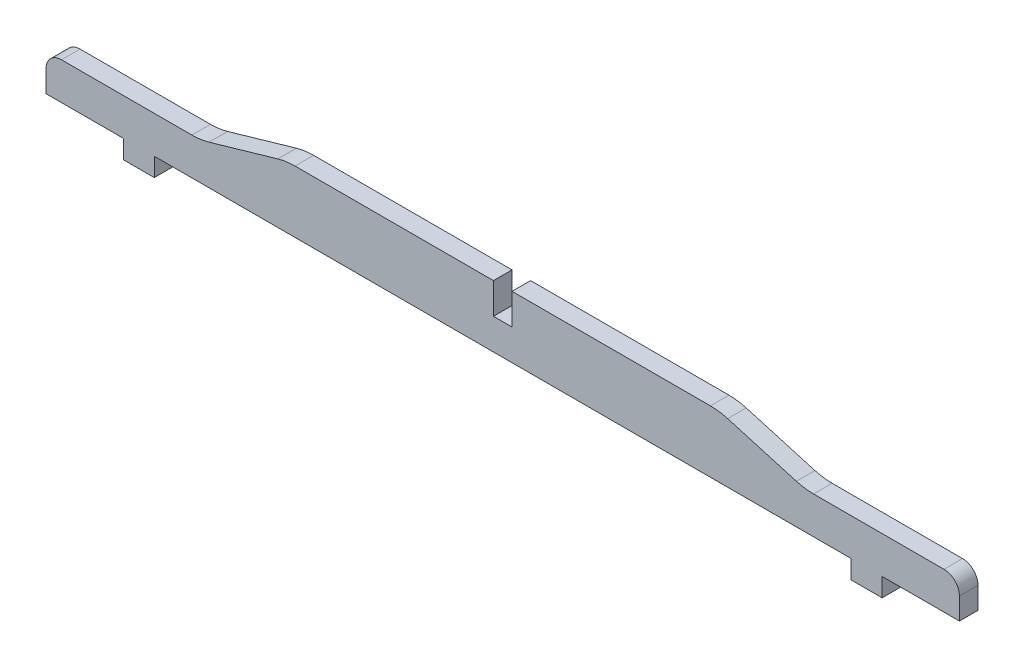
ISO-10303-21;
HEADER;
FILE_DESCRIPTION(('STEP AP214'),'2;1');
FILE_NAME('part.step','',(''),(''),'','','');
FILE_SCHEMA(('AUTOMOTIVE_DESIGN { 1 0 10303 214 1 1 1 1 }'));
ENDSEC;
DATA;
#1=APPLICATION_CONTEXT('core data for automotive mechanical design processes');
#2=APPLICATION_PROTOCOL_DEFINITION('international standard','automotive_design',2000,#1);
#3=PRODUCT_CONTEXT('',#1,'mechanical');
#4=PRODUCT('Part','Part','',(#3));
#5=PRODUCT_RELATED_PRODUCT_CATEGORY('part','',(#4));
#6=PRODUCT_DEFINITION_FORMATION('','',#4);
#7=PRODUCT_DEFINITION_CONTEXT('part definition',#1,'design');
#8=PRODUCT_DEFINITION('design','',#6,#7);
#9=PRODUCT_DEFINITION_SHAPE('','',#8);
#10=(LENGTH_UNIT() NAMED_UNIT(*) SI_UNIT(.MILLI.,.METRE.));
#11=(NAMED_UNIT(*) PLANE_ANGLE_UNIT() SI_UNIT($,.RADIAN.));
#12=(NAMED_UNIT(*) SI_UNIT($,.STERADIAN.) SOLID_ANGLE_UNIT());
#13=UNCERTAINTY_MEASURE_WITH_UNIT(LENGTH_MEASURE(1.E-05),#10,'distance_accuracy_value','');
#14=(GEOMETRIC_REPRESENTATION_CONTEXT(3) GLOBAL_UNCERTAINTY_ASSIGNED_CONTEXT((#13)) GLOBAL_UNIT_ASSIGNED_CONTEXT((#10,
#11,#12)) REPRESENTATION_CONTEXT('',''));
#15=CARTESIAN_POINT('',(0.,0.,0.));
#16=DIRECTION('',(0.,0.,1.));
#17=DIRECTION('',(1.,0.,0.));
#18=AXIS2_PLACEMENT_3D('',#15,#16,#17);
#19=CARTESIAN_POINT('',(70.,0.,6.));
#20=DIRECTION('',(0.,-1.,0.));
#21=DIRECTION('',(0.,0.,-1.));
#22=AXIS2_PLACEMENT_3D('',#19,#20,#21);
#23=PLANE('',#22);
#24=DIRECTION('',(-1.,0.,0.));
#25=VECTOR('',#24,1.);
#26=CARTESIAN_POINT('',(70.,0.,6.));
#27=LINE('',#26,#25);
#28=CARTESIAN_POINT('',(-3.,0.,6.));
#29=VERTEX_POINT('',#28);
#30=CARTESIAN_POINT('',(-67.1664737660185,0.,6.));
#31=VERTEX_POINT('',#30);
#32=EDGE_CURVE('E261',#29,#31,#27,.T.);
#33=ORIENTED_EDGE('',*,*,#32,.F.);
#34=DIRECTION('',(0.,0.,1.));
#35=VECTOR('',#34,1.);
#36=CARTESIAN_POINT('',(-3.,0.,0.));
#37=LINE('',#36,#35);
#38=CARTESIAN_POINT('',(-3.,0.,0.));
#39=VERTEX_POINT('',#38);
#40=EDGE_CURVE('E234',#39,#29,#37,.T.);
#41=ORIENTED_EDGE('',*,*,#40,.F.);
#42=DIRECTION('',(-1.,0.,0.));
#43=VECTOR('',#42,1.);
#44=CARTESIAN_POINT('',(70.,0.,0.));
#45=LINE('',#44,#43);
#46=CARTESIAN_POINT('',(-67.1664737660185,0.,0.));
#47=VERTEX_POINT('',#46);
#48=EDGE_CURVE('E230',#39,#47,#45,.T.);
#49=ORIENTED_EDGE('',*,*,#48,.T.);
#50=DIRECTION('',(0.,0.,-1.));
#51=VECTOR('',#50,1.);
#52=CARTESIAN_POINT('',(-67.1664737660185,0.,6.));
#53=LINE('',#52,#51);
#54=EDGE_CURVE('E378',#47,#31,#53,.F.);
#55=ORIENTED_EDGE('',*,*,#54,.T.);
#56=EDGE_LOOP('',(#33,#41,#49,#55));
#57=FACE_BOUND('',#56,.T.);
#58=ADVANCED_FACE('F38',(#57),#23,.F.);
#59=CARTESIAN_POINT('',(122.66666667,-26.,6.));
#60=DIRECTION('',(-1.,0.,0.));
#61=DIRECTION('',(0.,0.,1.));
#62=AXIS2_PLACEMENT_3D('',#59,#60,#61);
#63=PLANE('',#62);
#64=DIRECTION('',(0.,1.,0.));
#65=VECTOR('',#64,1.);
#66=CARTESIAN_POINT('',(122.66666667,-26.,0.));
#67=LINE('',#66,#65);
#68=CARTESIAN_POINT('',(122.66666667,-26.,0.));
#69=VERTEX_POINT('',#68);
#70=CARTESIAN_POINT('',(122.66666667,-20.,0.));
#71=VERTEX_POINT('',#70);
#72=EDGE_CURVE('E245',#69,#71,#67,.T.);
#73=ORIENTED_EDGE('',*,*,#72,.T.);
#74=DIRECTION('',(0.,0.,-1.));
#75=VECTOR('',#74,1.);
#76=CARTESIAN_POINT('',(122.66666667,-20.,6.));
#77=LINE('',#76,#75);
#78=CARTESIAN_POINT('',(122.66666667,-20.,6.));
#79=VERTEX_POINT('',#78);
#80=EDGE_CURVE('E348',#79,#71,#77,.T.);
#81=ORIENTED_EDGE('',*,*,#80,.F.);
#82=DIRECTION('',(0.,1.,0.));
#83=VECTOR('',#82,1.);
#84=CARTESIAN_POINT('',(122.66666667,-26.,6.));
#85=LINE('',#84,#83);
#86=CARTESIAN_POINT('',(122.66666667,-26.,6.));
#87=VERTEX_POINT('',#86);
#88=EDGE_CURVE('E246',#87,#79,#85,.T.);
#89=ORIENTED_EDGE('',*,*,#88,.F.);
#90=DIRECTION('',(0.,0.,-1.));
#91=VECTOR('',#90,1.);
#92=CARTESIAN_POINT('',(122.66666667,-26.,6.));
#93=LINE('',#92,#91);
#94=EDGE_CURVE('E285',#87,#69,#93,.T.);
#95=ORIENTED_EDGE('',*,*,#94,.T.);
#96=EDGE_LOOP('',(#73,#81,#89,#95));
#97=FACE_BOUND('',#96,.T.);
#98=ADVANCED_FACE('F464',(#97),#63,.F.);
#99=CARTESIAN_POINT('',(147.66666667,-20.,6.));
#100=DIRECTION('',(0.,1.,0.));
#101=DIRECTION('',(0.,0.,1.));
#102=AXIS2_PLACEMENT_3D('',#99,#100,#101);
#103=PLANE('',#102);
#104=DIRECTION('',(1.,0.,0.));
#105=VECTOR('',#104,1.);
#106=CARTESIAN_POINT('',(147.66666667,-20.,0.));
#107=LINE('',#106,#105);
#108=CARTESIAN_POINT('',(147.66666667,-20.,0.));
#109=VERTEX_POINT('',#108);
#110=EDGE_CURVE('E288',#71,#109,#107,.T.);
#111=ORIENTED_EDGE('',*,*,#110,.T.);
#112=DIRECTION('',(0.,0.,-1.));
#113=VECTOR('',#112,1.);
#114=CARTESIAN_POINT('',(147.66666667,-20.,6.));
#115=LINE('',#114,#113);
#116=CARTESIAN_POINT('',(147.66666667,-20.,6.));
#117=VERTEX_POINT('',#116);
#118=EDGE_CURVE('E345',#117,#109,#115,.T.);
#119=ORIENTED_EDGE('',*,*,#118,.F.);
#120=DIRECTION('',(1.,0.,0.));
#121=VECTOR('',#120,1.);
#122=CARTESIAN_POINT('',(147.66666667,-20.,6.));
#123=LINE('',#122,#121);
#124=EDGE_CURVE('E249',#79,#117,#123,.T.);
#125=ORIENTED_EDGE('',*,*,#124,.F.);
#126=ORIENTED_EDGE('',*,*,#80,.T.);
#127=EDGE_LOOP('',(#111,#119,#125,#126));
#128=FACE_BOUND('',#127,.T.);
#129=ADVANCED_FACE('F467',(#128),#103,.F.);
#130=CARTESIAN_POINT('',(147.66666667,-8.00000000000002,6.));
#131=DIRECTION('',(-1.,0.,0.));
#132=DIRECTION('',(0.,-1.,0.));
#133=AXIS2_PLACEMENT_3D('',#130,#131,#132);
#134=PLANE('',#133);
#135=DIRECTION('',(0.,1.,0.));
#136=VECTOR('',#135,1.);
#137=CARTESIAN_POINT('',(147.66666667,-8.00000000000002,0.));
#138=LINE('',#137,#136);
#139=CARTESIAN_POINT('',(147.66666667,-13.,0.));
#140=VERTEX_POINT('',#139);
#141=EDGE_CURVE('E290',#109,#140,#138,.T.);
#142=ORIENTED_EDGE('',*,*,#141,.T.);
#143=DIRECTION('',(0.,0.,-1.));
#144=VECTOR('',#143,1.);
#145=CARTESIAN_POINT('',(147.66666667,-13.,6.));
#146=LINE('',#145,#144);
#147=CARTESIAN_POINT('',(147.66666667,-13.,6.));
#148=VERTEX_POINT('',#147);
#149=EDGE_CURVE('E359',#140,#148,#146,.F.);
#150=ORIENTED_EDGE('',*,*,#149,.T.);
#151=DIRECTION('',(0.,1.,0.));
#152=VECTOR('',#151,1.);
#153=CARTESIAN_POINT('',(147.66666667,-8.00000000000002,6.));
#154=LINE('',#153,#152);
#155=EDGE_CURVE('E252',#117,#148,#154,.T.);
#156=ORIENTED_EDGE('',*,*,#155,.F.);
#157=ORIENTED_EDGE('',*,*,#118,.T.);
#158=EDGE_LOOP('',(#142,#150,#156,#157));
#159=FACE_BOUND('',#158,.T.);
#160=ADVANCED_FACE('F471',(#159),#134,.F.);
#161=CARTESIAN_POINT('',(97.66666667,-8.00000000000002,6.));
#162=DIRECTION('',(0.,-1.,0.));
#163=DIRECTION('',(1.,0.,0.));
#164=AXIS2_PLACEMENT_3D('',#161,#162,#163);
#165=PLANE('',#164);
#166=DIRECTION('',(-1.,0.,0.));
#167=VECTOR('',#166,1.);
#168=CARTESIAN_POINT('',(97.66666667,-8.00000000000002,0.));
#169=LINE('',#168,#167);
#170=CARTESIAN_POINT('',(142.66666667,-8.00000000000002,0.));
#171=VERTEX_POINT('',#170);
#172=CARTESIAN_POINT('',(100.500192903982,-8.00000000000002,0.));
#173=VERTEX_POINT('',#172);
#174=EDGE_CURVE('E293',#171,#173,#169,.T.);
#175=ORIENTED_EDGE('',*,*,#174,.T.);
#176=DIRECTION('',(0.,0.,-1.));
#177=VECTOR('',#176,1.);
#178=CARTESIAN_POINT('',(100.500192903982,-8.00000000000002,6.));
#179=LINE('',#178,#177);
#180=CARTESIAN_POINT('',(100.500192903982,-8.00000000000002,6.));
#181=VERTEX_POINT('',#180);
#182=EDGE_CURVE('E376',#173,#181,#179,.F.);
#183=ORIENTED_EDGE('',*,*,#182,.T.);
#184=DIRECTION('',(-1.,0.,0.));
#185=VECTOR('',#184,1.);
#186=CARTESIAN_POINT('',(97.66666667,-8.00000000000002,6.));
#187=LINE('',#186,#185);
#188=CARTESIAN_POINT('',(142.66666667,-8.00000000000002,6.));
#189=VERTEX_POINT('',#188);
#190=EDGE_CURVE('E255',#189,#181,#187,.T.);
#191=ORIENTED_EDGE('',*,*,#190,.F.);
#192=DIRECTION('',(0.,0.,-1.));
#193=VECTOR('',#192,1.);
#194=CARTESIAN_POINT('',(142.66666667,-8.00000000000002,6.));
#195=LINE('',#194,#193);
#196=EDGE_CURVE('E351',#189,#171,#195,.T.);
#197=ORIENTED_EDGE('',*,*,#196,.T.);
#198=EDGE_LOOP('',(#175,#183,#191,#197));
#199=FACE_BOUND('',#198,.T.);
#200=ADVANCED_FACE('F480',(#199),#165,.F.);
#201=CARTESIAN_POINT('',(70.,0.,6.));
#202=DIRECTION('',(-0.277777033532158,-0.960645574414453,0.));
#203=DIRECTION('',(0.960645574414453,-0.277777033532158,0.));
#204=AXIS2_PLACEMENT_3D('',#201,#202,#203);
#205=PLANE('',#204);
#206=DIRECTION('',(-0.960645574414453,0.277777033532158,0.));
#207=VECTOR('',#206,1.);
#208=CARTESIAN_POINT('',(70.,0.,6.));
#209=LINE('',#208,#207);
#210=CARTESIAN_POINT('',(94.9446522333384,-7.21291148828908,6.));
#211=VERTEX_POINT('',#210);
#212=CARTESIAN_POINT('',(72.7220144366616,-0.787088511710961,6.));
#213=VERTEX_POINT('',#212);
#214=EDGE_CURVE('E258',#211,#213,#209,.T.);
#215=ORIENTED_EDGE('',*,*,#214,.F.);
#216=DIRECTION('',(0.,0.,-1.));
#217=VECTOR('',#216,1.);
#218=CARTESIAN_POINT('',(94.9446522333384,-7.21291148828908,0.));
#219=LINE('',#218,#217);
#220=CARTESIAN_POINT('',(94.9446522333384,-7.21291148828908,0.));
#221=VERTEX_POINT('',#220);
#222=EDGE_CURVE('E373',#211,#221,#219,.T.);
#223=ORIENTED_EDGE('',*,*,#222,.T.);
#224=DIRECTION('',(-0.960645574414453,0.277777033532158,0.));
#225=VECTOR('',#224,1.);
#226=CARTESIAN_POINT('',(70.,0.,0.));
#227=LINE('',#226,#225);
#228=CARTESIAN_POINT('',(72.7220144366616,-0.787088511710961,0.));
#229=VERTEX_POINT('',#228);
#230=EDGE_CURVE('E296',#221,#229,#227,.T.);
#231=ORIENTED_EDGE('',*,*,#230,.T.);
#232=DIRECTION('',(0.,0.,-1.));
#233=VECTOR('',#232,1.);
#234=CARTESIAN_POINT('',(72.7220144366616,-0.787088511710961,6.));
#235=LINE('',#234,#233);
#236=EDGE_CURVE('E371',#229,#213,#235,.F.);
#237=ORIENTED_EDGE('',*,*,#236,.T.);
#238=EDGE_LOOP('',(#215,#223,#231,#237));
#239=FACE_BOUND('',#238,.T.);
#240=ADVANCED_FACE('F489',(#239),#205,.F.);
#241=CARTESIAN_POINT('',(67.1664737660185,0.,0.));
#242=VERTEX_POINT('',#241);
#243=CARTESIAN_POINT('',(3.,0.,0.));
#244=VERTEX_POINT('',#243);
#245=EDGE_CURVE('E299',#242,#244,#45,.T.);
#246=ORIENTED_EDGE('',*,*,#245,.T.);
#247=DIRECTION('',(0.,0.,1.));
#248=VECTOR('',#247,1.);
#249=CARTESIAN_POINT('',(3.,0.,0.));
#250=LINE('',#249,#248);
#251=CARTESIAN_POINT('',(3.,0.,6.));
#252=VERTEX_POINT('',#251);
#253=EDGE_CURVE('E237',#244,#252,#250,.T.);
#254=ORIENTED_EDGE('',*,*,#253,.T.);
#255=CARTESIAN_POINT('',(67.1664737660185,0.,6.));
#256=VERTEX_POINT('',#255);
#257=EDGE_CURVE('E262',#256,#252,#27,.T.);
#258=ORIENTED_EDGE('',*,*,#257,.F.);
#259=DIRECTION('',(0.,0.,-1.));
#260=VECTOR('',#259,1.);
#261=CARTESIAN_POINT('',(67.1664737660185,0.,6.));
#262=LINE('',#261,#260);
#263=EDGE_CURVE('E381',#256,#242,#262,.T.);
#264=ORIENTED_EDGE('',*,*,#263,.T.);
#265=EDGE_LOOP('',(#246,#254,#258,#264));
#266=FACE_BOUND('',#265,.T.);
#267=ADVANCED_FACE('F498',(#266),#23,.F.);
#268=CARTESIAN_POINT('',(-97.66666667,-8.00000000000002,6.));
#269=DIRECTION('',(0.277777033532158,-0.960645574414453,0.));
#270=DIRECTION('',(0.960645574414453,0.277777033532158,0.));
#271=AXIS2_PLACEMENT_3D('',#268,#269,#270);
#272=PLANE('',#271);
#273=DIRECTION('',(-0.960645574414453,-0.277777033532158,0.));
#274=VECTOR('',#273,1.);
#275=CARTESIAN_POINT('',(-97.66666667,-8.00000000000002,6.));
#276=LINE('',#275,#274);
#277=CARTESIAN_POINT('',(-72.7220144366616,-0.787088511710957,6.));
#278=VERTEX_POINT('',#277);
#279=CARTESIAN_POINT('',(-94.9446522333383,-7.21291148828908,6.));
#280=VERTEX_POINT('',#279);
#281=EDGE_CURVE('E265',#278,#280,#276,.T.);
#282=ORIENTED_EDGE('',*,*,#281,.F.);
#283=DIRECTION('',(0.,0.,-1.));
#284=VECTOR('',#283,1.);
#285=CARTESIAN_POINT('',(-72.7220144366616,-0.787088511710958,6.));
#286=LINE('',#285,#284);
#287=CARTESIAN_POINT('',(-72.7220144366616,-0.787088511710957,0.));
#288=VERTEX_POINT('',#287);
#289=EDGE_CURVE('E394',#278,#288,#286,.T.);
#290=ORIENTED_EDGE('',*,*,#289,.T.);
#291=DIRECTION('',(-0.960645574414453,-0.277777033532158,0.));
#292=VECTOR('',#291,1.);
#293=CARTESIAN_POINT('',(-97.66666667,-8.00000000000002,0.));
#294=LINE('',#293,#292);
#295=CARTESIAN_POINT('',(-94.9446522333383,-7.21291148828908,0.));
#296=VERTEX_POINT('',#295);
#297=EDGE_CURVE('E302',#288,#296,#294,.T.);
#298=ORIENTED_EDGE('',*,*,#297,.T.);
#299=DIRECTION('',(0.,0.,-1.));
#300=VECTOR('',#299,1.);
#301=CARTESIAN_POINT('',(-94.9446522333383,-7.21291148828908,6.));
#302=LINE('',#301,#300);
#303=EDGE_CURVE('E392',#296,#280,#302,.F.);
#304=ORIENTED_EDGE('',*,*,#303,.T.);
#305=EDGE_LOOP('',(#282,#290,#298,#304));
#306=FACE_BOUND('',#305,.T.);
#307=ADVANCED_FACE('F410',(#306),#272,.F.);
#308=CARTESIAN_POINT('',(-147.66666667,-8.00000000000002,6.));
#309=DIRECTION('',(0.,-1.,0.));
#310=DIRECTION('',(1.,0.,0.));
#311=AXIS2_PLACEMENT_3D('',#308,#309,#310);
#312=PLANE('',#311);
#313=DIRECTION('',(-1.,0.,0.));
#314=VECTOR('',#313,1.);
#315=CARTESIAN_POINT('',(-147.66666667,-8.00000000000002,6.));
#316=LINE('',#315,#314);
#317=CARTESIAN_POINT('',(-100.500192903981,-8.00000000000002,6.));
#318=VERTEX_POINT('',#317);
#319=CARTESIAN_POINT('',(-142.66666667,-8.00000000000002,6.));
#320=VERTEX_POINT('',#319);
#321=EDGE_CURVE('E267',#318,#320,#316,.T.);
#322=ORIENTED_EDGE('',*,*,#321,.F.);
#323=DIRECTION('',(0.,0.,-1.));
#324=VECTOR('',#323,1.);
#325=CARTESIAN_POINT('',(-100.500192903981,-8.00000000000003,0.));
#326=LINE('',#325,#324);
#327=CARTESIAN_POINT('',(-100.500192903981,-8.00000000000002,0.));
#328=VERTEX_POINT('',#327);
#329=EDGE_CURVE('E397',#318,#328,#326,.T.);
#330=ORIENTED_EDGE('',*,*,#329,.T.);
#331=DIRECTION('',(-1.,0.,0.));
#332=VECTOR('',#331,1.);
#333=CARTESIAN_POINT('',(-147.66666667,-8.00000000000002,0.));
#334=LINE('',#333,#332);
#335=CARTESIAN_POINT('',(-142.66666667,-8.00000000000002,0.));
#336=VERTEX_POINT('',#335);
#337=EDGE_CURVE('E305',#328,#336,#334,.T.);
#338=ORIENTED_EDGE('',*,*,#337,.T.);
#339=DIRECTION('',(0.,0.,-1.));
#340=VECTOR('',#339,1.);
#341=CARTESIAN_POINT('',(-142.66666667,-8.00000000000002,6.));
#342=LINE('',#341,#340);
#343=EDGE_CURVE('E368',#336,#320,#342,.F.);
#344=ORIENTED_EDGE('',*,*,#343,.T.);
#345=EDGE_LOOP('',(#322,#330,#338,#344));
#346=FACE_BOUND('',#345,.T.);
#347=ADVANCED_FACE('F413',(#346),#312,.F.);
#348=CARTESIAN_POINT('',(-147.66666667,-20.,6.));
#349=DIRECTION('',(1.,0.,0.));
#350=DIRECTION('',(0.,1.,0.));
#351=AXIS2_PLACEMENT_3D('',#348,#349,#350);
#352=PLANE('',#351);
#353=DIRECTION('',(0.,-1.,0.));
#354=VECTOR('',#353,1.);
#355=CARTESIAN_POINT('',(-147.66666667,-20.,6.));
#356=LINE('',#355,#354);
#357=CARTESIAN_POINT('',(-147.66666667,-13.,6.));
#358=VERTEX_POINT('',#357);
#359=CARTESIAN_POINT('',(-147.66666667,-20.,6.));
#360=VERTEX_POINT('',#359);
#361=EDGE_CURVE('E269',#358,#360,#356,.T.);
#362=ORIENTED_EDGE('',*,*,#361,.F.);
#363=DIRECTION('',(0.,0.,-1.));
#364=VECTOR('',#363,1.);
#365=CARTESIAN_POINT('',(-147.66666667,-13.,6.));
#366=LINE('',#365,#364);
#367=CARTESIAN_POINT('',(-147.66666667,-13.,0.));
#368=VERTEX_POINT('',#367);
#369=EDGE_CURVE('E365',#358,#368,#366,.T.);
#370=ORIENTED_EDGE('',*,*,#369,.T.);
#371=DIRECTION('',(0.,-1.,0.));
#372=VECTOR('',#371,1.);
#373=CARTESIAN_POINT('',(-147.66666667,-20.,0.));
#374=LINE('',#373,#372);
#375=CARTESIAN_POINT('',(-147.66666667,-20.,0.));
#376=VERTEX_POINT('',#375);
#377=EDGE_CURVE('E307',#368,#376,#374,.T.);
#378=ORIENTED_EDGE('',*,*,#377,.T.);
#379=DIRECTION('',(0.,0.,-1.));
#380=VECTOR('',#379,1.);
#381=CARTESIAN_POINT('',(-147.66666667,-20.,6.));
#382=LINE('',#381,#380);
#383=EDGE_CURVE('E342',#360,#376,#382,.T.);
#384=ORIENTED_EDGE('',*,*,#383,.F.);
#385=EDGE_LOOP('',(#362,#370,#378,#384));
#386=FACE_BOUND('',#385,.T.);
#387=ADVANCED_FACE('F422',(#386),#352,.F.);
#388=CARTESIAN_POINT('',(-147.66666667,-20.,6.));
#389=DIRECTION('',(0.,1.,0.));
#390=DIRECTION('',(0.,0.,1.));
#391=AXIS2_PLACEMENT_3D('',#388,#389,#390);
#392=PLANE('',#391);
#393=DIRECTION('',(1.,0.,0.));
#394=VECTOR('',#393,1.);
#395=CARTESIAN_POINT('',(-147.66666667,-20.,0.));
#396=LINE('',#395,#394);
#397=CARTESIAN_POINT('',(-122.66666667,-20.,0.));
#398=VERTEX_POINT('',#397);
#399=EDGE_CURVE('E309',#376,#398,#396,.T.);
#400=ORIENTED_EDGE('',*,*,#399,.T.);
#401=DIRECTION('',(0.,0.,-1.));
#402=VECTOR('',#401,1.);
#403=CARTESIAN_POINT('',(-122.66666667,-20.,6.));
#404=LINE('',#403,#402);
#405=CARTESIAN_POINT('',(-122.66666667,-20.,6.));
#406=VERTEX_POINT('',#405);
#407=EDGE_CURVE('E339',#406,#398,#404,.T.);
#408=ORIENTED_EDGE('',*,*,#407,.F.);
#409=DIRECTION('',(1.,0.,0.));
#410=VECTOR('',#409,1.);
#411=CARTESIAN_POINT('',(-147.66666667,-20.,6.));
#412=LINE('',#411,#410);
#413=EDGE_CURVE('E271',#360,#406,#412,.T.);
#414=ORIENTED_EDGE('',*,*,#413,.F.);
#415=ORIENTED_EDGE('',*,*,#383,.T.);
#416=EDGE_LOOP('',(#400,#408,#414,#415));
#417=FACE_BOUND('',#416,.T.);
#418=ADVANCED_FACE('F429',(#417),#392,.F.);
#419=CARTESIAN_POINT('',(-122.66666667,-20.,6.));
#420=DIRECTION('',(1.,0.,0.));
#421=DIRECTION('',(0.,0.,-1.));
#422=AXIS2_PLACEMENT_3D('',#419,#420,#421);
#423=PLANE('',#422);
#424=DIRECTION('',(0.,-1.,0.));
#425=VECTOR('',#424,1.);
#426=CARTESIAN_POINT('',(-122.66666667,-20.,0.));
#427=LINE('',#426,#425);
#428=CARTESIAN_POINT('',(-122.66666667,-26.,0.));
#429=VERTEX_POINT('',#428);
#430=EDGE_CURVE('E311',#398,#429,#427,.T.);
#431=ORIENTED_EDGE('',*,*,#430,.T.);
#432=DIRECTION('',(0.,0.,-1.));
#433=VECTOR('',#432,1.);
#434=CARTESIAN_POINT('',(-122.66666667,-26.,6.));
#435=LINE('',#434,#433);
#436=CARTESIAN_POINT('',(-122.66666667,-26.,6.));
#437=VERTEX_POINT('',#436);
#438=EDGE_CURVE('E336',#437,#429,#435,.T.);
#439=ORIENTED_EDGE('',*,*,#438,.F.);
#440=DIRECTION('',(0.,-1.,0.));
#441=VECTOR('',#440,1.);
#442=CARTESIAN_POINT('',(-122.66666667,-20.,6.));
#443=LINE('',#442,#441);
#444=EDGE_CURVE('E273',#406,#437,#443,.T.);
#445=ORIENTED_EDGE('',*,*,#444,.F.);
#446=ORIENTED_EDGE('',*,*,#407,.T.);
#447=EDGE_LOOP('',(#431,#439,#445,#446));
#448=FACE_BOUND('',#447,.T.);
#449=ADVANCED_FACE('F436',(#448),#423,.F.);
#450=CARTESIAN_POINT('',(-122.66666667,-26.,6.));
#451=DIRECTION('',(0.,1.,0.));
#452=DIRECTION('',(0.,0.,1.));
#453=AXIS2_PLACEMENT_3D('',#450,#451,#452);
#454=PLANE('',#453);
#455=DIRECTION('',(1.,0.,0.));
#456=VECTOR('',#455,1.);
#457=CARTESIAN_POINT('',(-122.66666667,-26.,0.));
#458=LINE('',#457,#456);
#459=CARTESIAN_POINT('',(-112.66666667,-26.,0.));
#460=VERTEX_POINT('',#459);
#461=EDGE_CURVE('E313',#429,#460,#458,.T.);
#462=ORIENTED_EDGE('',*,*,#461,.T.);
#463=DIRECTION('',(0.,0.,-1.));
#464=VECTOR('',#463,1.);
#465=CARTESIAN_POINT('',(-112.66666667,-26.,6.));
#466=LINE('',#465,#464);
#467=CARTESIAN_POINT('',(-112.66666667,-26.,6.));
#468=VERTEX_POINT('',#467);
#469=EDGE_CURVE('E333',#468,#460,#466,.T.);
#470=ORIENTED_EDGE('',*,*,#469,.F.);
#471=DIRECTION('',(1.,0.,0.));
#472=VECTOR('',#471,1.);
#473=CARTESIAN_POINT('',(-122.66666667,-26.,6.));
#474=LINE('',#473,#472);
#475=EDGE_CURVE('E275',#437,#468,#474,.T.);
#476=ORIENTED_EDGE('',*,*,#475,.F.);
#477=ORIENTED_EDGE('',*,*,#438,.T.);
#478=EDGE_LOOP('',(#462,#470,#476,#477));
#479=FACE_BOUND('',#478,.T.);
#480=ADVANCED_FACE('F439',(#479),#454,.F.);
#481=CARTESIAN_POINT('',(-112.66666667,-26.,6.));
#482=DIRECTION('',(-1.,0.,0.));
#483=DIRECTION('',(0.,0.,1.));
#484=AXIS2_PLACEMENT_3D('',#481,#482,#483);
#485=PLANE('',#484);
#486=DIRECTION('',(0.,1.,0.));
#487=VECTOR('',#486,1.);
#488=CARTESIAN_POINT('',(-112.66666667,-26.,0.));
#489=LINE('',#488,#487);
#490=CARTESIAN_POINT('',(-112.66666667,-20.,0.));
#491=VERTEX_POINT('',#490);
#492=EDGE_CURVE('E315',#460,#491,#489,.T.);
#493=ORIENTED_EDGE('',*,*,#492,.T.);
#494=DIRECTION('',(0.,0.,-1.));
#495=VECTOR('',#494,1.);
#496=CARTESIAN_POINT('',(-112.66666667,-20.,6.));
#497=LINE('',#496,#495);
#498=CARTESIAN_POINT('',(-112.66666667,-20.,6.));
#499=VERTEX_POINT('',#498);
#500=EDGE_CURVE('E330',#499,#491,#497,.T.);
#501=ORIENTED_EDGE('',*,*,#500,.F.);
#502=DIRECTION('',(0.,1.,0.));
#503=VECTOR('',#502,1.);
#504=CARTESIAN_POINT('',(-112.66666667,-26.,6.));
#505=LINE('',#504,#503);
#506=EDGE_CURVE('E277',#468,#499,#505,.T.);
#507=ORIENTED_EDGE('',*,*,#506,.F.);
#508=ORIENTED_EDGE('',*,*,#469,.T.);
#509=EDGE_LOOP('',(#493,#501,#507,#508));
#510=FACE_BOUND('',#509,.T.);
#511=ADVANCED_FACE('F444',(#510),#485,.F.);
#512=CARTESIAN_POINT('',(112.66666667,-20.,6.));
#513=DIRECTION('',(0.,1.,0.));
#514=DIRECTION('',(0.,0.,1.));
#515=AXIS2_PLACEMENT_3D('',#512,#513,#514);
#516=PLANE('',#515);
#517=DIRECTION('',(1.,0.,0.));
#518=VECTOR('',#517,1.);
#519=CARTESIAN_POINT('',(112.66666667,-20.,0.));
#520=LINE('',#519,#518);
#521=CARTESIAN_POINT('',(112.66666667,-20.,0.));
#522=VERTEX_POINT('',#521);
#523=EDGE_CURVE('E317',#491,#522,#520,.T.);
#524=ORIENTED_EDGE('',*,*,#523,.T.);
#525=DIRECTION('',(0.,0.,-1.));
#526=VECTOR('',#525,1.);
#527=CARTESIAN_POINT('',(112.66666667,-20.,6.));
#528=LINE('',#527,#526);
#529=CARTESIAN_POINT('',(112.66666667,-20.,6.));
#530=VERTEX_POINT('',#529);
#531=EDGE_CURVE('E327',#530,#522,#528,.T.);
#532=ORIENTED_EDGE('',*,*,#531,.F.);
#533=DIRECTION('',(1.,0.,0.));
#534=VECTOR('',#533,1.);
#535=CARTESIAN_POINT('',(112.66666667,-20.,6.));
#536=LINE('',#535,#534);
#537=EDGE_CURVE('E279',#499,#530,#536,.T.);
#538=ORIENTED_EDGE('',*,*,#537,.F.);
#539=ORIENTED_EDGE('',*,*,#500,.T.);
#540=EDGE_LOOP('',(#524,#532,#538,#539));
#541=FACE_BOUND('',#540,.T.);
#542=ADVANCED_FACE('F450',(#541),#516,.F.);
#543=CARTESIAN_POINT('',(112.66666667,-20.,6.));
#544=DIRECTION('',(1.,0.,0.));
#545=DIRECTION('',(0.,0.,-1.));
#546=AXIS2_PLACEMENT_3D('',#543,#544,#545);
#547=PLANE('',#546);
#548=DIRECTION('',(0.,-1.,0.));
#549=VECTOR('',#548,1.);
#550=CARTESIAN_POINT('',(112.66666667,-20.,0.));
#551=LINE('',#550,#549);
#552=CARTESIAN_POINT('',(112.66666667,-26.,0.));
#553=VERTEX_POINT('',#552);
#554=EDGE_CURVE('E319',#522,#553,#551,.T.);
#555=ORIENTED_EDGE('',*,*,#554,.T.);
#556=DIRECTION('',(0.,0.,-1.));
#557=VECTOR('',#556,1.);
#558=CARTESIAN_POINT('',(112.66666667,-26.,6.));
#559=LINE('',#558,#557);
#560=CARTESIAN_POINT('',(112.66666667,-26.,6.));
#561=VERTEX_POINT('',#560);
#562=EDGE_CURVE('E324',#561,#553,#559,.T.);
#563=ORIENTED_EDGE('',*,*,#562,.F.);
#564=DIRECTION('',(0.,-1.,0.));
#565=VECTOR('',#564,1.);
#566=CARTESIAN_POINT('',(112.66666667,-20.,6.));
#567=LINE('',#566,#565);
#568=EDGE_CURVE('E281',#530,#561,#567,.T.);
#569=ORIENTED_EDGE('',*,*,#568,.F.);
#570=ORIENTED_EDGE('',*,*,#531,.T.);
#571=EDGE_LOOP('',(#555,#563,#569,#570));
#572=FACE_BOUND('',#571,.T.);
#573=ADVANCED_FACE('F454',(#572),#547,.F.);
#574=CARTESIAN_POINT('',(112.66666667,-26.,6.));
#575=DIRECTION('',(0.,1.,0.));
#576=DIRECTION('',(0.,0.,1.));
#577=AXIS2_PLACEMENT_3D('',#574,#575,#576);
#578=PLANE('',#577);
#579=DIRECTION('',(1.,0.,0.));
#580=VECTOR('',#579,1.);
#581=CARTESIAN_POINT('',(112.66666667,-26.,0.));
#582=LINE('',#581,#580);
#583=EDGE_CURVE('E250',#553,#69,#582,.T.);
#584=ORIENTED_EDGE('',*,*,#583,.T.);
#585=ORIENTED_EDGE('',*,*,#94,.F.);
#586=DIRECTION('',(1.,0.,0.));
#587=VECTOR('',#586,1.);
#588=CARTESIAN_POINT('',(112.66666667,-26.,6.));
#589=LINE('',#588,#587);
#590=EDGE_CURVE('E283',#561,#87,#589,.T.);
#591=ORIENTED_EDGE('',*,*,#590,.F.);
#592=ORIENTED_EDGE('',*,*,#562,.T.);
#593=EDGE_LOOP('',(#584,#585,#591,#592));
#594=FACE_BOUND('',#593,.T.);
#595=ADVANCED_FACE('F459',(#594),#578,.F.);
#596=CARTESIAN_POINT('',(0.,0.,6.));
#597=DIRECTION('',(0.,0.,1.));
#598=DIRECTION('',(1.,0.,0.));
#599=AXIS2_PLACEMENT_3D('',#596,#597,#598);
#600=PLANE('',#599);
#601=DIRECTION('',(0.,-1.,0.));
#602=VECTOR('',#601,1.);
#603=CARTESIAN_POINT('',(-3.,0.,6.));
#604=LINE('',#603,#602);
#605=CARTESIAN_POINT('',(-3.,-10.,6.));
#606=VERTEX_POINT('',#605);
#607=EDGE_CURVE('E217',#29,#606,#604,.T.);
#608=ORIENTED_EDGE('',*,*,#607,.F.);
#609=ORIENTED_EDGE('',*,*,#32,.T.);
#610=CARTESIAN_POINT('',(-67.1664737660185,-20.,6.));
#611=DIRECTION('',(0.,0.,1.));
#612=DIRECTION('',(1.,0.,0.));
#613=AXIS2_PLACEMENT_3D('',#610,#611,#612);
#614=CIRCLE('',#613,20.);
#615=EDGE_CURVE('E388',#31,#278,#614,.T.);
#616=ORIENTED_EDGE('',*,*,#615,.T.);
#617=ORIENTED_EDGE('',*,*,#281,.T.);
#618=CARTESIAN_POINT('',(-100.500192903981,12.,6.));
#619=DIRECTION('',(0.,0.,1.));
#620=DIRECTION('',(1.,0.,0.));
#621=AXIS2_PLACEMENT_3D('',#618,#619,#620);
#622=CIRCLE('',#621,20.);
#623=EDGE_CURVE('E11',#280,#318,#622,.F.);
#624=ORIENTED_EDGE('',*,*,#623,.T.);
#625=ORIENTED_EDGE('',*,*,#321,.T.);
#626=CARTESIAN_POINT('',(-142.66666667,-13.,6.));
#627=DIRECTION('',(0.,0.,1.));
#628=DIRECTION('',(1.,0.,0.));
#629=AXIS2_PLACEMENT_3D('',#626,#627,#628);
#630=CIRCLE('',#629,5.);
#631=EDGE_CURVE('E361',#320,#358,#630,.T.);
#632=ORIENTED_EDGE('',*,*,#631,.T.);
#633=ORIENTED_EDGE('',*,*,#361,.T.);
#634=ORIENTED_EDGE('',*,*,#413,.T.);
#635=ORIENTED_EDGE('',*,*,#444,.T.);
#636=ORIENTED_EDGE('',*,*,#475,.T.);
#637=ORIENTED_EDGE('',*,*,#506,.T.);
#638=ORIENTED_EDGE('',*,*,#537,.T.);
#639=ORIENTED_EDGE('',*,*,#568,.T.);
#640=ORIENTED_EDGE('',*,*,#590,.T.);
#641=ORIENTED_EDGE('',*,*,#88,.T.);
#642=ORIENTED_EDGE('',*,*,#124,.T.);
#643=ORIENTED_EDGE('',*,*,#155,.T.);
#644=CARTESIAN_POINT('',(142.66666667,-13.,6.));
#645=DIRECTION('',(0.,0.,1.));
#646=DIRECTION('',(1.,0.,0.));
#647=AXIS2_PLACEMENT_3D('',#644,#645,#646);
#648=CIRCLE('',#647,5.);
#649=EDGE_CURVE('E363',#148,#189,#648,.T.);
#650=ORIENTED_EDGE('',*,*,#649,.T.);
#651=ORIENTED_EDGE('',*,*,#190,.T.);
#652=CARTESIAN_POINT('',(100.500192903982,12.,6.));
#653=DIRECTION('',(0.,0.,1.));
#654=DIRECTION('',(1.,0.,0.));
#655=AXIS2_PLACEMENT_3D('',#652,#653,#654);
#656=CIRCLE('',#655,20.);
#657=EDGE_CURVE('E402',#181,#211,#656,.F.);
#658=ORIENTED_EDGE('',*,*,#657,.T.);
#659=ORIENTED_EDGE('',*,*,#214,.T.);
#660=CARTESIAN_POINT('',(67.1664737660185,-20.,6.));
#661=DIRECTION('',(0.,0.,1.));
#662=DIRECTION('',(1.,0.,0.));
#663=AXIS2_PLACEMENT_3D('',#660,#661,#662);
#664=CIRCLE('',#663,20.);
#665=EDGE_CURVE('E390',#213,#256,#664,.T.);
#666=ORIENTED_EDGE('',*,*,#665,.T.);
#667=ORIENTED_EDGE('',*,*,#257,.T.);
#668=DIRECTION('',(0.,1.,0.));
#669=VECTOR('',#668,1.);
#670=CARTESIAN_POINT('',(3.,0.,6.));
#671=LINE('',#670,#669);
#672=CARTESIAN_POINT('',(3.,-10.,6.));
#673=VERTEX_POINT('',#672);
#674=EDGE_CURVE('E242',#673,#252,#671,.T.);
#675=ORIENTED_EDGE('',*,*,#674,.F.);
#676=DIRECTION('',(1.,0.,0.));
#677=VECTOR('',#676,1.);
#678=CARTESIAN_POINT('',(0.,-10.,6.));
#679=LINE('',#678,#677);
#680=EDGE_CURVE('E236',#606,#673,#679,.T.);
#681=ORIENTED_EDGE('',*,*,#680,.F.);
#682=EDGE_LOOP('',(#608,#609,#616,#617,#624,#625,#632,#633,#634,#635,#636,#637,#638,#639,#640,
#641,#642,#643,#650,#651,#658,#659,#666,#667,#675,#681));
#683=FACE_BOUND('',#682,.T.);
#684=ADVANCED_FACE('F416',(#683),#600,.T.);
#685=CARTESIAN_POINT('',(0.,0.,0.));
#686=DIRECTION('',(0.,0.,1.));
#687=DIRECTION('',(1.,0.,0.));
#688=AXIS2_PLACEMENT_3D('',#685,#686,#687);
#689=PLANE('',#688);
#690=ORIENTED_EDGE('',*,*,#48,.F.);
#691=DIRECTION('',(0.,-1.,0.));
#692=VECTOR('',#691,1.);
#693=CARTESIAN_POINT('',(-3.,-10.,0.));
#694=LINE('',#693,#692);
#695=CARTESIAN_POINT('',(-3.,-10.,0.));
#696=VERTEX_POINT('',#695);
#697=EDGE_CURVE('E214',#39,#696,#694,.T.);
#698=ORIENTED_EDGE('',*,*,#697,.T.);
#699=DIRECTION('',(1.,0.,0.));
#700=VECTOR('',#699,1.);
#701=CARTESIAN_POINT('',(-3.,-10.,0.));
#702=LINE('',#701,#700);
#703=CARTESIAN_POINT('',(3.,-10.,0.));
#704=VERTEX_POINT('',#703);
#705=EDGE_CURVE('E223',#696,#704,#702,.T.);
#706=ORIENTED_EDGE('',*,*,#705,.T.);
#707=DIRECTION('',(0.,1.,0.));
#708=VECTOR('',#707,1.);
#709=CARTESIAN_POINT('',(3.,-10.,0.));
#710=LINE('',#709,#708);
#711=EDGE_CURVE('E53',#704,#244,#710,.T.);
#712=ORIENTED_EDGE('',*,*,#711,.T.);
#713=ORIENTED_EDGE('',*,*,#245,.F.);
#714=CARTESIAN_POINT('',(67.1664737660185,-20.,0.));
#715=DIRECTION('',(0.,0.,1.));
#716=DIRECTION('',(1.,0.,0.));
#717=AXIS2_PLACEMENT_3D('',#714,#715,#716);
#718=CIRCLE('',#717,20.);
#719=EDGE_CURVE('E386',#242,#229,#718,.F.);
#720=ORIENTED_EDGE('',*,*,#719,.T.);
#721=ORIENTED_EDGE('',*,*,#230,.F.);
#722=CARTESIAN_POINT('',(100.500192903982,12.,0.));
#723=DIRECTION('',(0.,0.,1.));
#724=DIRECTION('',(1.,0.,0.));
#725=AXIS2_PLACEMENT_3D('',#722,#723,#724);
#726=CIRCLE('',#725,20.);
#727=EDGE_CURVE('E400',#221,#173,#726,.T.);
#728=ORIENTED_EDGE('',*,*,#727,.T.);
#729=ORIENTED_EDGE('',*,*,#174,.F.);
#730=CARTESIAN_POINT('',(142.66666667,-13.,0.));
#731=DIRECTION('',(0.,0.,1.));
#732=DIRECTION('',(1.,0.,0.));
#733=AXIS2_PLACEMENT_3D('',#730,#731,#732);
#734=CIRCLE('',#733,5.);
#735=EDGE_CURVE('E357',#171,#140,#734,.F.);
#736=ORIENTED_EDGE('',*,*,#735,.T.);
#737=ORIENTED_EDGE('',*,*,#141,.F.);
#738=ORIENTED_EDGE('',*,*,#110,.F.);
#739=ORIENTED_EDGE('',*,*,#72,.F.);
#740=ORIENTED_EDGE('',*,*,#583,.F.);
#741=ORIENTED_EDGE('',*,*,#554,.F.);
#742=ORIENTED_EDGE('',*,*,#523,.F.);
#743=ORIENTED_EDGE('',*,*,#492,.F.);
#744=ORIENTED_EDGE('',*,*,#461,.F.);
#745=ORIENTED_EDGE('',*,*,#430,.F.);
#746=ORIENTED_EDGE('',*,*,#399,.F.);
#747=ORIENTED_EDGE('',*,*,#377,.F.);
#748=CARTESIAN_POINT('',(-142.66666667,-13.,0.));
#749=DIRECTION('',(0.,0.,1.));
#750=DIRECTION('',(1.,0.,0.));
#751=AXIS2_PLACEMENT_3D('',#748,#749,#750);
#752=CIRCLE('',#751,5.);
#753=EDGE_CURVE('E354',#368,#336,#752,.F.);
#754=ORIENTED_EDGE('',*,*,#753,.T.);
#755=ORIENTED_EDGE('',*,*,#337,.F.);
#756=CARTESIAN_POINT('',(-100.500192903981,12.,0.));
#757=DIRECTION('',(0.,0.,1.));
#758=DIRECTION('',(1.,0.,0.));
#759=AXIS2_PLACEMENT_3D('',#756,#757,#758);
#760=CIRCLE('',#759,20.);
#761=EDGE_CURVE('E46',#328,#296,#760,.T.);
#762=ORIENTED_EDGE('',*,*,#761,.T.);
#763=ORIENTED_EDGE('',*,*,#297,.F.);
#764=CARTESIAN_POINT('',(-67.1664737660185,-20.,0.));
#765=DIRECTION('',(0.,0.,1.));
#766=DIRECTION('',(1.,0.,0.));
#767=AXIS2_PLACEMENT_3D('',#764,#765,#766);
#768=CIRCLE('',#767,20.);
#769=EDGE_CURVE('E384',#288,#47,#768,.F.);
#770=ORIENTED_EDGE('',*,*,#769,.T.);
#771=EDGE_LOOP('',(#690,#698,#706,#712,#713,#720,#721,#728,#729,#736,#737,#738,#739,#740,#741,
#742,#743,#744,#745,#746,#747,#754,#755,#762,#763,#770));
#772=FACE_BOUND('',#771,.T.);
#773=ADVANCED_FACE('F228',(#772),#689,.F.);
#774=CARTESIAN_POINT('',(142.66666667,-13.,6.));
#775=DIRECTION('',(0.,0.,-1.));
#776=DIRECTION('',(-1.,0.,0.));
#777=AXIS2_PLACEMENT_3D('',#774,#775,#776);
#778=CYLINDRICAL_SURFACE('',#777,5.);
#779=ORIENTED_EDGE('',*,*,#649,.F.);
#780=ORIENTED_EDGE('',*,*,#149,.F.);
#781=ORIENTED_EDGE('',*,*,#735,.F.);
#782=ORIENTED_EDGE('',*,*,#196,.F.);
#783=EDGE_LOOP('',(#779,#780,#781,#782));
#784=FACE_BOUND('',#783,.T.);
#785=ADVANCED_FACE('F477',(#784),#778,.T.);
#786=CARTESIAN_POINT('',(-142.66666667,-13.,6.));
#787=DIRECTION('',(0.,0.,-1.));
#788=DIRECTION('',(-1.,0.,0.));
#789=AXIS2_PLACEMENT_3D('',#786,#787,#788);
#790=CYLINDRICAL_SURFACE('',#789,5.);
#791=ORIENTED_EDGE('',*,*,#631,.F.);
#792=ORIENTED_EDGE('',*,*,#343,.F.);
#793=ORIENTED_EDGE('',*,*,#753,.F.);
#794=ORIENTED_EDGE('',*,*,#369,.F.);
#795=EDGE_LOOP('',(#791,#792,#793,#794));
#796=FACE_BOUND('',#795,.T.);
#797=ADVANCED_FACE('F425',(#796),#790,.T.);
#798=CARTESIAN_POINT('',(100.500192903982,12.,6.));
#799=DIRECTION('',(0.,0.,1.));
#800=DIRECTION('',(1.,0.,0.));
#801=AXIS2_PLACEMENT_3D('',#798,#799,#800);
#802=CYLINDRICAL_SURFACE('',#801,20.);
#803=ORIENTED_EDGE('',*,*,#657,.F.);
#804=ORIENTED_EDGE('',*,*,#182,.F.);
#805=ORIENTED_EDGE('',*,*,#727,.F.);
#806=ORIENTED_EDGE('',*,*,#222,.F.);
#807=EDGE_LOOP('',(#803,#804,#805,#806));
#808=FACE_BOUND('',#807,.T.);
#809=ADVANCED_FACE('F486',(#808),#802,.F.);
#810=CARTESIAN_POINT('',(67.1664737660185,-20.,6.));
#811=DIRECTION('',(0.,0.,-1.));
#812=DIRECTION('',(-1.,0.,0.));
#813=AXIS2_PLACEMENT_3D('',#810,#811,#812);
#814=CYLINDRICAL_SURFACE('',#813,20.);
#815=ORIENTED_EDGE('',*,*,#665,.F.);
#816=ORIENTED_EDGE('',*,*,#236,.F.);
#817=ORIENTED_EDGE('',*,*,#719,.F.);
#818=ORIENTED_EDGE('',*,*,#263,.F.);
#819=EDGE_LOOP('',(#815,#816,#817,#818));
#820=FACE_BOUND('',#819,.T.);
#821=ADVANCED_FACE('F495',(#820),#814,.T.);
#822=CARTESIAN_POINT('',(-67.1664737660185,-20.,6.));
#823=DIRECTION('',(0.,0.,-1.));
#824=DIRECTION('',(-1.,0.,0.));
#825=AXIS2_PLACEMENT_3D('',#822,#823,#824);
#826=CYLINDRICAL_SURFACE('',#825,20.);
#827=ORIENTED_EDGE('',*,*,#615,.F.);
#828=ORIENTED_EDGE('',*,*,#54,.F.);
#829=ORIENTED_EDGE('',*,*,#769,.F.);
#830=ORIENTED_EDGE('',*,*,#289,.F.);
#831=EDGE_LOOP('',(#827,#828,#829,#830));
#832=FACE_BOUND('',#831,.T.);
#833=ADVANCED_FACE('F540',(#832),#826,.T.);
#834=CARTESIAN_POINT('',(-100.500192903981,12.,6.));
#835=DIRECTION('',(0.,0.,1.));
#836=DIRECTION('',(1.,0.,0.));
#837=AXIS2_PLACEMENT_3D('',#834,#835,#836);
#838=CYLINDRICAL_SURFACE('',#837,20.);
#839=ORIENTED_EDGE('',*,*,#623,.F.);
#840=ORIENTED_EDGE('',*,*,#303,.F.);
#841=ORIENTED_EDGE('',*,*,#761,.F.);
#842=ORIENTED_EDGE('',*,*,#329,.F.);
#843=EDGE_LOOP('',(#839,#840,#841,#842));
#844=FACE_BOUND('',#843,.T.);
#845=ADVANCED_FACE('F40',(#844),#838,.F.);
#846=CARTESIAN_POINT('',(-3.,-10.,0.));
#847=DIRECTION('',(-1.,0.,0.));
#848=DIRECTION('',(0.,0.,1.));
#849=AXIS2_PLACEMENT_3D('',#846,#847,#848);
#850=PLANE('',#849);
#851=ORIENTED_EDGE('',*,*,#607,.T.);
#852=DIRECTION('',(0.,0.,1.));
#853=VECTOR('',#852,1.);
#854=CARTESIAN_POINT('',(-3.,-10.,0.));
#855=LINE('',#854,#853);
#856=EDGE_CURVE('E210',#696,#606,#855,.T.);
#857=ORIENTED_EDGE('',*,*,#856,.F.);
#858=ORIENTED_EDGE('',*,*,#697,.F.);
#859=ORIENTED_EDGE('',*,*,#40,.T.);
#860=EDGE_LOOP('',(#851,#857,#858,#859));
#861=FACE_BOUND('',#860,.T.);
#862=ADVANCED_FACE('F212',(#861),#850,.F.);
#863=CARTESIAN_POINT('',(3.,-10.,0.));
#864=DIRECTION('',(1.,0.,0.));
#865=DIRECTION('',(0.,1.,0.));
#866=AXIS2_PLACEMENT_3D('',#863,#864,#865);
#867=PLANE('',#866);
#868=ORIENTED_EDGE('',*,*,#674,.T.);
#869=ORIENTED_EDGE('',*,*,#253,.F.);
#870=ORIENTED_EDGE('',*,*,#711,.F.);
#871=DIRECTION('',(0.,0.,1.));
#872=VECTOR('',#871,1.);
#873=CARTESIAN_POINT('',(3.,-10.,0.));
#874=LINE('',#873,#872);
#875=EDGE_CURVE('E220',#704,#673,#874,.T.);
#876=ORIENTED_EDGE('',*,*,#875,.T.);
#877=EDGE_LOOP('',(#868,#869,#870,#876));
#878=FACE_BOUND('',#877,.T.);
#879=ADVANCED_FACE('F500',(#878),#867,.F.);
#880=CARTESIAN_POINT('',(-3.,-10.,0.));
#881=DIRECTION('',(0.,-1.,0.));
#882=DIRECTION('',(0.,0.,-1.));
#883=AXIS2_PLACEMENT_3D('',#880,#881,#882);
#884=PLANE('',#883);
#885=ORIENTED_EDGE('',*,*,#680,.T.);
#886=ORIENTED_EDGE('',*,*,#875,.F.);
#887=ORIENTED_EDGE('',*,*,#705,.F.);
#888=ORIENTED_EDGE('',*,*,#856,.T.);
#889=EDGE_LOOP('',(#885,#886,#887,#888));
#890=FACE_BOUND('',#889,.T.);
#891=ADVANCED_FACE('F224',(#890),#884,.F.);
#892=CLOSED_SHELL('',(#58,#98,#129,#160,#200,#240,#267,#307,#347,#387,#418,#449,#480,#511,#542,
#573,#595,#684,#773,#785,#797,#809,#821,#833,#845,#862,#879,#891));
#893=MANIFOLD_SOLID_BREP('B2',#892);
#894=ADVANCED_BREP_SHAPE_REPRESENTATION('',(#18,#893),#14);
#895=SHAPE_DEFINITION_REPRESENTATION(#9,#894);
ENDSEC;
END-ISO-10303-21;
